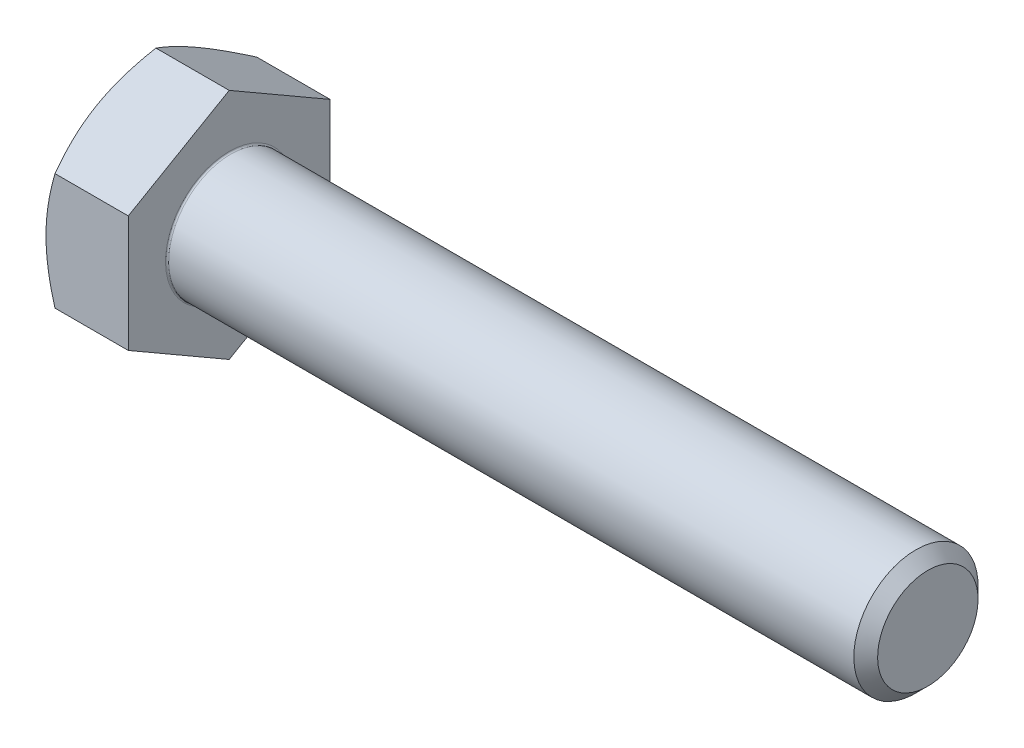
ISO-10303-21;
HEADER;
FILE_DESCRIPTION(('STEP AP214'),'2;1');
FILE_NAME('part.step','',(''),(''),'','','');
FILE_SCHEMA(('AUTOMOTIVE_DESIGN { 1 0 10303 214 1 1 1 1 }'));
ENDSEC;
DATA;
#1=APPLICATION_CONTEXT('core data for automotive mechanical design processes');
#2=APPLICATION_PROTOCOL_DEFINITION('international standard','automotive_design',2000,#1);
#3=PRODUCT_CONTEXT('',#1,'mechanical');
#4=PRODUCT('Part','Part','',(#3));
#5=PRODUCT_RELATED_PRODUCT_CATEGORY('part','',(#4));
#6=PRODUCT_DEFINITION_FORMATION('','',#4);
#7=PRODUCT_DEFINITION_CONTEXT('part definition',#1,'design');
#8=PRODUCT_DEFINITION('design','',#6,#7);
#9=PRODUCT_DEFINITION_SHAPE('','',#8);
#10=(LENGTH_UNIT() NAMED_UNIT(*) SI_UNIT(.MILLI.,.METRE.));
#11=(NAMED_UNIT(*) PLANE_ANGLE_UNIT() SI_UNIT($,.RADIAN.));
#12=(NAMED_UNIT(*) SI_UNIT($,.STERADIAN.) SOLID_ANGLE_UNIT());
#13=UNCERTAINTY_MEASURE_WITH_UNIT(LENGTH_MEASURE(1.E-05),#10,'distance_accuracy_value','');
#14=(GEOMETRIC_REPRESENTATION_CONTEXT(3) GLOBAL_UNCERTAINTY_ASSIGNED_CONTEXT((#13)) GLOBAL_UNIT_ASSIGNED_CONTEXT((#10,
#11,#12)) REPRESENTATION_CONTEXT('',''));
#15=CARTESIAN_POINT('',(0.,0.,0.));
#16=DIRECTION('',(0.,0.,1.));
#17=DIRECTION('',(1.,0.,0.));
#18=AXIS2_PLACEMENT_3D('',#15,#16,#17);
#19=CARTESIAN_POINT('',(-5.3,0.,0.));
#20=DIRECTION('',(1.,0.,0.));
#21=DIRECTION('',(0.,1.,0.));
#22=AXIS2_PLACEMENT_3D('',#19,#20,#21);
#23=PLANE('',#22);
#24=CARTESIAN_POINT('',(-5.3,0.,0.));
#25=DIRECTION('',(-1.,0.,0.));
#26=DIRECTION('',(0.,1.,0.));
#27=AXIS2_PLACEMENT_3D('',#24,#25,#26);
#28=CIRCLE('',#27,6.5);
#29=CARTESIAN_POINT('',(-5.3,5.62916512459885,-3.25));
#30=VERTEX_POINT('',#29);
#31=CARTESIAN_POINT('',(-5.3,0.,-6.5));
#32=VERTEX_POINT('',#31);
#33=EDGE_CURVE('E247',#30,#32,#28,.T.);
#34=ORIENTED_EDGE('',*,*,#33,.T.);
#35=CARTESIAN_POINT('',(-5.3,0.,0.));
#36=DIRECTION('',(-1.,0.,0.));
#37=DIRECTION('',(0.,1.,0.));
#38=AXIS2_PLACEMENT_3D('',#35,#36,#37);
#39=CIRCLE('',#38,6.5);
#40=CARTESIAN_POINT('',(-5.3,-5.62916512459885,-3.25));
#41=VERTEX_POINT('',#40);
#42=EDGE_CURVE('E175',#32,#41,#39,.T.);
#43=ORIENTED_EDGE('',*,*,#42,.T.);
#44=CARTESIAN_POINT('',(-5.3,0.,0.));
#45=DIRECTION('',(-1.,0.,0.));
#46=DIRECTION('',(0.,1.,0.));
#47=AXIS2_PLACEMENT_3D('',#44,#45,#46);
#48=CIRCLE('',#47,6.5);
#49=CARTESIAN_POINT('',(-5.3,-5.62916512459885,3.25));
#50=VERTEX_POINT('',#49);
#51=EDGE_CURVE('E158',#41,#50,#48,.T.);
#52=ORIENTED_EDGE('',*,*,#51,.T.);
#53=CARTESIAN_POINT('',(-5.3,0.,0.));
#54=DIRECTION('',(-1.,0.,0.));
#55=DIRECTION('',(0.,1.,0.));
#56=AXIS2_PLACEMENT_3D('',#53,#54,#55);
#57=CIRCLE('',#56,6.5);
#58=CARTESIAN_POINT('',(-5.3,0.,6.5));
#59=VERTEX_POINT('',#58);
#60=EDGE_CURVE('E159',#50,#59,#57,.T.);
#61=ORIENTED_EDGE('',*,*,#60,.T.);
#62=CARTESIAN_POINT('',(-5.3,0.,0.));
#63=DIRECTION('',(-1.,0.,0.));
#64=DIRECTION('',(0.,1.,0.));
#65=AXIS2_PLACEMENT_3D('',#62,#63,#64);
#66=CIRCLE('',#65,6.5);
#67=CARTESIAN_POINT('',(-5.3,5.62916512459885,3.25));
#68=VERTEX_POINT('',#67);
#69=EDGE_CURVE('E146',#59,#68,#66,.T.);
#70=ORIENTED_EDGE('',*,*,#69,.T.);
#71=CARTESIAN_POINT('',(-5.3,0.,0.));
#72=DIRECTION('',(-1.,0.,0.));
#73=DIRECTION('',(0.,1.,0.));
#74=AXIS2_PLACEMENT_3D('',#71,#72,#73);
#75=CIRCLE('',#74,6.5);
#76=EDGE_CURVE('E202',#68,#30,#75,.T.);
#77=ORIENTED_EDGE('',*,*,#76,.T.);
#78=EDGE_LOOP('',(#34,#43,#52,#61,#70,#77));
#79=FACE_BOUND('',#78,.T.);
#80=ADVANCED_FACE('F16',(#79),#23,.F.);
#81=CARTESIAN_POINT('',(0.,7.50555349946513,0.));
#82=DIRECTION('',(0.,0.866025403784438,0.5));
#83=DIRECTION('',(1.,0.,0.));
#84=AXIS2_PLACEMENT_3D('',#81,#82,#83);
#85=PLANE('',#84);
#86=CARTESIAN_POINT('',(-5.3,5.62916512459885,3.25));
#87=CARTESIAN_POINT('',(-5.3,4.7583302491977,4.75833024919769));
#88=CARTESIAN_POINT('',(-4.71944341639924,3.75277674973256,6.5));
#89=(BOUNDED_CURVE() B_SPLINE_CURVE(2,(#86,#87,#88),.UNSPECIFIED.,.F.,
.F.) B_SPLINE_CURVE_WITH_KNOTS((3,3),(0.439000868202294,0.827027033445395),
.UNSPECIFIED.) CURVE() GEOMETRIC_REPRESENTATION_ITEM() RATIONAL_B_SPLINE_CURVE((1.,
1.04314139574018,1.0100187493574)) REPRESENTATION_ITEM(''));
#90=CARTESIAN_POINT('',(-4.71944341639924,3.75277674973256,6.5));
#91=VERTEX_POINT('',#90);
#92=EDGE_CURVE('E150',#68,#91,#89,.T.);
#93=ORIENTED_EDGE('',*,*,#92,.T.);
#94=DIRECTION('',(-1.,0.,0.));
#95=VECTOR('',#94,1.);
#96=CARTESIAN_POINT('',(0.,3.75277674973256,6.5));
#97=LINE('',#96,#95);
#98=CARTESIAN_POINT('',(0.,3.75277674973256,6.5));
#99=VERTEX_POINT('',#98);
#100=EDGE_CURVE('E20',#99,#91,#97,.T.);
#101=ORIENTED_EDGE('',*,*,#100,.F.);
#102=DIRECTION('',(0.,-0.5,0.866025403784438));
#103=VECTOR('',#102,1.);
#104=CARTESIAN_POINT('',(0.,7.50555349946513,0.));
#105=LINE('',#104,#103);
#106=CARTESIAN_POINT('',(0.,7.50555349946513,0.));
#107=VERTEX_POINT('',#106);
#108=EDGE_CURVE('E266',#107,#99,#105,.T.);
#109=ORIENTED_EDGE('',*,*,#108,.F.);
#110=DIRECTION('',(-1.,0.,0.));
#111=VECTOR('',#110,1.);
#112=CARTESIAN_POINT('',(0.,7.50555349946513,0.));
#113=LINE('',#112,#111);
#114=CARTESIAN_POINT('',(-4.71944341639924,7.50555349946513,0.));
#115=VERTEX_POINT('',#114);
#116=EDGE_CURVE('E11',#107,#115,#113,.T.);
#117=ORIENTED_EDGE('',*,*,#116,.T.);
#118=CARTESIAN_POINT('',(-4.71944341639924,7.50555349946513,0.));
#119=CARTESIAN_POINT('',(-5.3,6.5,1.74166975080231));
#120=CARTESIAN_POINT('',(-5.3,5.62916512459885,3.25));
#121=(BOUNDED_CURVE() B_SPLINE_CURVE(2,(#118,#119,#120),.UNSPECIFIED.,.F.,
.F.) B_SPLINE_CURVE_WITH_KNOTS((3,3),(0.050974702959193,0.439000868202294),
.UNSPECIFIED.) CURVE() GEOMETRIC_REPRESENTATION_ITEM() RATIONAL_B_SPLINE_CURVE((1.01001874935741,
1.04314139574019,1.)) REPRESENTATION_ITEM(''));
#122=EDGE_CURVE('E226',#115,#68,#121,.T.);
#123=ORIENTED_EDGE('',*,*,#122,.T.);
#124=EDGE_LOOP('',(#93,#101,#109,#117,#123));
#125=FACE_BOUND('',#124,.T.);
#126=ADVANCED_FACE('F354',(#125),#85,.T.);
#127=CARTESIAN_POINT('',(0.,3.75277674973257,-6.5));
#128=DIRECTION('',(0.,0.866025403784439,-0.5));
#129=DIRECTION('',(-1.,0.,0.));
#130=AXIS2_PLACEMENT_3D('',#127,#128,#129);
#131=PLANE('',#130);
#132=CARTESIAN_POINT('',(-5.3,5.62916512459885,-3.25));
#133=CARTESIAN_POINT('',(-5.3,6.49999999999999,-1.7416697508023));
#134=CARTESIAN_POINT('',(-4.71944341639924,7.50555349946513,0.));
#135=(BOUNDED_CURVE() B_SPLINE_CURVE(2,(#132,#133,#134),.UNSPECIFIED.,.F.,
.F.) B_SPLINE_CURVE_WITH_KNOTS((3,3),(0.439000868202294,0.827027033445395),
.UNSPECIFIED.) CURVE() GEOMETRIC_REPRESENTATION_ITEM() RATIONAL_B_SPLINE_CURVE((1.,
1.04314139574018,1.0100187493574)) REPRESENTATION_ITEM(''));
#136=EDGE_CURVE('E209',#30,#115,#135,.T.);
#137=ORIENTED_EDGE('',*,*,#136,.T.);
#138=ORIENTED_EDGE('',*,*,#116,.F.);
#139=DIRECTION('',(0.,0.5,0.866025403784439));
#140=VECTOR('',#139,1.);
#141=CARTESIAN_POINT('',(0.,3.75277674973257,-6.5));
#142=LINE('',#141,#140);
#143=CARTESIAN_POINT('',(0.,3.75277674973257,-6.5));
#144=VERTEX_POINT('',#143);
#145=EDGE_CURVE('E123',#144,#107,#142,.T.);
#146=ORIENTED_EDGE('',*,*,#145,.F.);
#147=DIRECTION('',(-1.,0.,0.));
#148=VECTOR('',#147,1.);
#149=CARTESIAN_POINT('',(0.,3.75277674973257,-6.5));
#150=LINE('',#149,#148);
#151=CARTESIAN_POINT('',(-4.71944341639924,3.75277674973257,-6.5));
#152=VERTEX_POINT('',#151);
#153=EDGE_CURVE('E39',#144,#152,#150,.T.);
#154=ORIENTED_EDGE('',*,*,#153,.T.);
#155=CARTESIAN_POINT('',(-4.71944341639924,3.75277674973257,-6.49999999999999));
#156=CARTESIAN_POINT('',(-5.3,4.75833024919771,-4.75833024919768));
#157=CARTESIAN_POINT('',(-5.3,5.62916512459885,-3.25));
#158=(BOUNDED_CURVE() B_SPLINE_CURVE(2,(#155,#156,#157),.UNSPECIFIED.,.F.,
.F.) B_SPLINE_CURVE_WITH_KNOTS((3,3),(0.0509747029591937,0.439000868202294),
.UNSPECIFIED.) CURVE() GEOMETRIC_REPRESENTATION_ITEM() RATIONAL_B_SPLINE_CURVE((1.0100187493574,
1.04314139574017,1.)) REPRESENTATION_ITEM(''));
#159=EDGE_CURVE('E268',#152,#30,#158,.T.);
#160=ORIENTED_EDGE('',*,*,#159,.T.);
#161=EDGE_LOOP('',(#137,#138,#146,#154,#160));
#162=FACE_BOUND('',#161,.T.);
#163=ADVANCED_FACE('F125',(#162),#131,.T.);
#164=CARTESIAN_POINT('',(0.,3.75277674973256,6.5));
#165=DIRECTION('',(0.,0.,1.));
#166=DIRECTION('',(0.,-1.,0.));
#167=AXIS2_PLACEMENT_3D('',#164,#165,#166);
#168=PLANE('',#167);
#169=CARTESIAN_POINT('',(-5.3,0.,6.5));
#170=CARTESIAN_POINT('',(-5.3,-1.74166975080229,6.5));
#171=CARTESIAN_POINT('',(-4.71944341639924,-3.75277674973257,6.49999999999999));
#172=(BOUNDED_CURVE() B_SPLINE_CURVE(2,(#169,#170,#171),.UNSPECIFIED.,.F.,
.F.) B_SPLINE_CURVE_WITH_KNOTS((3,3),(0.439000868202295,0.827027033445395),
.UNSPECIFIED.) CURVE() GEOMETRIC_REPRESENTATION_ITEM() RATIONAL_B_SPLINE_CURVE((1.,
1.04314139574018,1.0100187493574)) REPRESENTATION_ITEM(''));
#173=CARTESIAN_POINT('',(-4.71944341639924,-3.75277674973257,6.5));
#174=VERTEX_POINT('',#173);
#175=EDGE_CURVE('E166',#59,#174,#172,.T.);
#176=ORIENTED_EDGE('',*,*,#175,.T.);
#177=DIRECTION('',(-1.,0.,0.));
#178=VECTOR('',#177,1.);
#179=CARTESIAN_POINT('',(0.,-3.75277674973257,6.5));
#180=LINE('',#179,#178);
#181=CARTESIAN_POINT('',(0.,-3.75277674973257,6.5));
#182=VERTEX_POINT('',#181);
#183=EDGE_CURVE('E215',#182,#174,#180,.T.);
#184=ORIENTED_EDGE('',*,*,#183,.F.);
#185=DIRECTION('',(0.,-1.,0.));
#186=VECTOR('',#185,1.);
#187=CARTESIAN_POINT('',(0.,3.75277674973256,6.5));
#188=LINE('',#187,#186);
#189=EDGE_CURVE('E145',#99,#182,#188,.T.);
#190=ORIENTED_EDGE('',*,*,#189,.F.);
#191=ORIENTED_EDGE('',*,*,#100,.T.);
#192=CARTESIAN_POINT('',(-4.71944341639924,3.75277674973256,6.5));
#193=CARTESIAN_POINT('',(-5.3,1.74166975080229,6.50000000000001));
#194=CARTESIAN_POINT('',(-5.3,0.,6.5));
#195=(BOUNDED_CURVE() B_SPLINE_CURVE(2,(#192,#193,#194),.UNSPECIFIED.,.F.,
.F.) B_SPLINE_CURVE_WITH_KNOTS((3,3),(0.0509747029591941,0.439000868202295),
.UNSPECIFIED.) CURVE() GEOMETRIC_REPRESENTATION_ITEM() RATIONAL_B_SPLINE_CURVE((1.01001874935741,
1.04314139574019,1.)) REPRESENTATION_ITEM(''));
#196=EDGE_CURVE('E193',#91,#59,#195,.T.);
#197=ORIENTED_EDGE('',*,*,#196,.T.);
#198=EDGE_LOOP('',(#176,#184,#190,#191,#197));
#199=FACE_BOUND('',#198,.T.);
#200=ADVANCED_FACE('F353',(#199),#168,.T.);
#201=CARTESIAN_POINT('',(0.,-3.75277674973256,-6.5));
#202=DIRECTION('',(0.,0.,-1.));
#203=DIRECTION('',(-1.,0.,0.));
#204=AXIS2_PLACEMENT_3D('',#201,#202,#203);
#205=PLANE('',#204);
#206=CARTESIAN_POINT('',(-4.71944341639924,-3.75277674973256,-6.5));
#207=CARTESIAN_POINT('',(-5.3,-1.74166975080228,-6.50000000000001));
#208=CARTESIAN_POINT('',(-5.3,0.,-6.5));
#209=(BOUNDED_CURVE() B_SPLINE_CURVE(2,(#206,#207,#208),.UNSPECIFIED.,.F.,
.F.) B_SPLINE_CURVE_WITH_KNOTS((3,3),(0.0509747029591942,0.439000868202295),
.UNSPECIFIED.) CURVE() GEOMETRIC_REPRESENTATION_ITEM() RATIONAL_B_SPLINE_CURVE((1.0100187493574,
1.04314139574017,1.)) REPRESENTATION_ITEM(''));
#210=CARTESIAN_POINT('',(-4.71944341639924,-3.75277674973256,-6.5));
#211=VERTEX_POINT('',#210);
#212=EDGE_CURVE('E179',#211,#32,#209,.T.);
#213=ORIENTED_EDGE('',*,*,#212,.T.);
#214=CARTESIAN_POINT('',(-5.3,0.,-6.5));
#215=CARTESIAN_POINT('',(-5.3,1.74166975080229,-6.49999999999999));
#216=CARTESIAN_POINT('',(-4.71944341639924,3.75277674973257,-6.49999999999999));
#217=(BOUNDED_CURVE() B_SPLINE_CURVE(2,(#214,#215,#216),.UNSPECIFIED.,.F.,
.F.) B_SPLINE_CURVE_WITH_KNOTS((3,3),(0.439000868202295,0.827027033445395),
.UNSPECIFIED.) CURVE() GEOMETRIC_REPRESENTATION_ITEM() RATIONAL_B_SPLINE_CURVE((1.,
1.04314139574018,1.0100187493574)) REPRESENTATION_ITEM(''));
#218=EDGE_CURVE('E117',#32,#152,#217,.T.);
#219=ORIENTED_EDGE('',*,*,#218,.T.);
#220=ORIENTED_EDGE('',*,*,#153,.F.);
#221=DIRECTION('',(0.,1.,0.));
#222=VECTOR('',#221,1.);
#223=CARTESIAN_POINT('',(0.,-3.75277674973256,-6.5));
#224=LINE('',#223,#222);
#225=CARTESIAN_POINT('',(0.,-3.75277674973256,-6.5));
#226=VERTEX_POINT('',#225);
#227=EDGE_CURVE('E114',#226,#144,#224,.T.);
#228=ORIENTED_EDGE('',*,*,#227,.F.);
#229=DIRECTION('',(-1.,0.,0.));
#230=VECTOR('',#229,1.);
#231=CARTESIAN_POINT('',(0.,-3.75277674973256,-6.5));
#232=LINE('',#231,#230);
#233=EDGE_CURVE('E119',#226,#211,#232,.T.);
#234=ORIENTED_EDGE('',*,*,#233,.T.);
#235=EDGE_LOOP('',(#213,#219,#220,#228,#234));
#236=FACE_BOUND('',#235,.T.);
#237=ADVANCED_FACE('F111',(#236),#205,.T.);
#238=CARTESIAN_POINT('',(0.,-7.50555349946513,0.));
#239=DIRECTION('',(0.,-0.866025403784439,-0.5));
#240=DIRECTION('',(0.,0.5,-0.866025403784439));
#241=AXIS2_PLACEMENT_3D('',#238,#239,#240);
#242=PLANE('',#241);
#243=CARTESIAN_POINT('',(-4.71944341639924,-7.50555349946513,0.));
#244=CARTESIAN_POINT('',(-5.3,-6.5,-1.74166975080231));
#245=CARTESIAN_POINT('',(-5.3,-5.62916512459885,-3.25));
#246=(BOUNDED_CURVE() B_SPLINE_CURVE(2,(#243,#244,#245),.UNSPECIFIED.,.F.,
.F.) B_SPLINE_CURVE_WITH_KNOTS((3,3),(0.0509747029591947,0.439000868202295),
.UNSPECIFIED.) CURVE() GEOMETRIC_REPRESENTATION_ITEM() RATIONAL_B_SPLINE_CURVE((1.0100187493574,
1.04314139574017,1.)) REPRESENTATION_ITEM(''));
#247=CARTESIAN_POINT('',(-4.71944341639924,-7.50555349946513,0.));
#248=VERTEX_POINT('',#247);
#249=EDGE_CURVE('E151',#248,#41,#246,.T.);
#250=ORIENTED_EDGE('',*,*,#249,.T.);
#251=CARTESIAN_POINT('',(-5.3,-5.62916512459885,-3.25));
#252=CARTESIAN_POINT('',(-5.3,-4.7583302491977,-4.7583302491977));
#253=CARTESIAN_POINT('',(-4.71944341639924,-3.75277674973256,-6.5));
#254=(BOUNDED_CURVE() B_SPLINE_CURVE(2,(#251,#252,#253),.UNSPECIFIED.,.F.,
.F.) B_SPLINE_CURVE_WITH_KNOTS((3,3),(0.439000868202295,0.827027033445396),
.UNSPECIFIED.) CURVE() GEOMETRIC_REPRESENTATION_ITEM() RATIONAL_B_SPLINE_CURVE((1.,
1.04314139574018,1.0100187493574)) REPRESENTATION_ITEM(''));
#255=EDGE_CURVE('E157',#41,#211,#254,.T.);
#256=ORIENTED_EDGE('',*,*,#255,.T.);
#257=ORIENTED_EDGE('',*,*,#233,.F.);
#258=DIRECTION('',(0.,0.5,-0.866025403784438));
#259=VECTOR('',#258,1.);
#260=CARTESIAN_POINT('',(0.,-7.50555349946513,0.));
#261=LINE('',#260,#259);
#262=CARTESIAN_POINT('',(0.,-7.50555349946513,0.));
#263=VERTEX_POINT('',#262);
#264=EDGE_CURVE('E134',#263,#226,#261,.T.);
#265=ORIENTED_EDGE('',*,*,#264,.F.);
#266=DIRECTION('',(-1.,0.,0.));
#267=VECTOR('',#266,1.);
#268=CARTESIAN_POINT('',(0.,-7.50555349946513,0.));
#269=LINE('',#268,#267);
#270=EDGE_CURVE('E222',#263,#248,#269,.T.);
#271=ORIENTED_EDGE('',*,*,#270,.T.);
#272=EDGE_LOOP('',(#250,#256,#257,#265,#271));
#273=FACE_BOUND('',#272,.T.);
#274=ADVANCED_FACE('F303',(#273),#242,.T.);
#275=CARTESIAN_POINT('',(0.,-3.75277674973257,6.5));
#276=DIRECTION('',(0.,-0.866025403784439,0.5));
#277=DIRECTION('',(-1.,0.,0.));
#278=AXIS2_PLACEMENT_3D('',#275,#276,#277);
#279=PLANE('',#278);
#280=CARTESIAN_POINT('',(-4.71944341639924,-3.75277674973257,6.49999999999999));
#281=CARTESIAN_POINT('',(-5.30000000000001,-4.75833024919771,4.75833024919769));
#282=CARTESIAN_POINT('',(-5.3,-5.62916512459885,3.25));
#283=(BOUNDED_CURVE() B_SPLINE_CURVE(2,(#280,#281,#282),.UNSPECIFIED.,.F.,
.F.) B_SPLINE_CURVE_WITH_KNOTS((3,3),(0.0509747029591935,0.439000868202295),
.UNSPECIFIED.) CURVE() GEOMETRIC_REPRESENTATION_ITEM() RATIONAL_B_SPLINE_CURVE((1.01001874935741,
1.04314139574019,1.)) REPRESENTATION_ITEM(''));
#284=EDGE_CURVE('E149',#174,#50,#283,.T.);
#285=ORIENTED_EDGE('',*,*,#284,.T.);
#286=CARTESIAN_POINT('',(-5.3,-5.62916512459885,3.25));
#287=CARTESIAN_POINT('',(-5.30000000000001,-6.49999999999999,1.74166975080231));
#288=CARTESIAN_POINT('',(-4.71944341639924,-7.50555349946513,0.));
#289=(BOUNDED_CURVE() B_SPLINE_CURVE(2,(#286,#287,#288),.UNSPECIFIED.,.F.,
.F.) B_SPLINE_CURVE_WITH_KNOTS((3,3),(0.439000868202295,0.827027033445396),
.UNSPECIFIED.) CURVE() GEOMETRIC_REPRESENTATION_ITEM() RATIONAL_B_SPLINE_CURVE((1.,
1.04314139574018,1.0100187493574)) REPRESENTATION_ITEM(''));
#290=EDGE_CURVE('E165',#50,#248,#289,.T.);
#291=ORIENTED_EDGE('',*,*,#290,.T.);
#292=ORIENTED_EDGE('',*,*,#270,.F.);
#293=DIRECTION('',(0.,-0.5,-0.866025403784439));
#294=VECTOR('',#293,1.);
#295=CARTESIAN_POINT('',(0.,-3.75277674973257,6.5));
#296=LINE('',#295,#294);
#297=EDGE_CURVE('E141',#182,#263,#296,.T.);
#298=ORIENTED_EDGE('',*,*,#297,.F.);
#299=ORIENTED_EDGE('',*,*,#183,.T.);
#300=EDGE_LOOP('',(#285,#291,#292,#298,#299));
#301=FACE_BOUND('',#300,.T.);
#302=ADVANCED_FACE('F344',(#301),#279,.T.);
#303=CARTESIAN_POINT('',(-4.92472232502675,0.,0.));
#304=DIRECTION('',(1.,0.,0.));
#305=DIRECTION('',(0.,1.,0.));
#306=AXIS2_PLACEMENT_3D('',#303,#304,#305);
#307=CONICAL_SURFACE('',#306,7.15,1.0471975512);
#308=ORIENTED_EDGE('',*,*,#218,.F.);
#309=ORIENTED_EDGE('',*,*,#33,.F.);
#310=ORIENTED_EDGE('',*,*,#159,.F.);
#311=EDGE_LOOP('',(#308,#309,#310));
#312=FACE_BOUND('',#311,.T.);
#313=ADVANCED_FACE('F375',(#312),#307,.T.);
#314=CARTESIAN_POINT('',(-4.92472232502675,0.,0.));
#315=DIRECTION('',(1.,0.,0.));
#316=DIRECTION('',(0.,1.,0.));
#317=AXIS2_PLACEMENT_3D('',#314,#315,#316);
#318=CONICAL_SURFACE('',#317,7.15,1.0471975512);
#319=ORIENTED_EDGE('',*,*,#255,.F.);
#320=ORIENTED_EDGE('',*,*,#42,.F.);
#321=ORIENTED_EDGE('',*,*,#212,.F.);
#322=EDGE_LOOP('',(#319,#320,#321));
#323=FACE_BOUND('',#322,.T.);
#324=ADVANCED_FACE('F302',(#323),#318,.T.);
#325=CARTESIAN_POINT('',(-4.92472232502675,0.,0.));
#326=DIRECTION('',(1.,0.,0.));
#327=DIRECTION('',(0.,1.,0.));
#328=AXIS2_PLACEMENT_3D('',#325,#326,#327);
#329=CONICAL_SURFACE('',#328,7.15,1.0471975512);
#330=ORIENTED_EDGE('',*,*,#290,.F.);
#331=ORIENTED_EDGE('',*,*,#51,.F.);
#332=ORIENTED_EDGE('',*,*,#249,.F.);
#333=EDGE_LOOP('',(#330,#331,#332));
#334=FACE_BOUND('',#333,.T.);
#335=ADVANCED_FACE('F310',(#334),#329,.T.);
#336=CARTESIAN_POINT('',(-4.92472232502675,0.,0.));
#337=DIRECTION('',(1.,0.,0.));
#338=DIRECTION('',(0.,1.,0.));
#339=AXIS2_PLACEMENT_3D('',#336,#337,#338);
#340=CONICAL_SURFACE('',#339,7.15,1.0471975512);
#341=ORIENTED_EDGE('',*,*,#284,.F.);
#342=ORIENTED_EDGE('',*,*,#175,.F.);
#343=ORIENTED_EDGE('',*,*,#60,.F.);
#344=EDGE_LOOP('',(#341,#342,#343));
#345=FACE_BOUND('',#344,.T.);
#346=ADVANCED_FACE('F414',(#345),#340,.T.);
#347=CARTESIAN_POINT('',(-4.92472232502675,0.,0.));
#348=DIRECTION('',(1.,0.,0.));
#349=DIRECTION('',(0.,1.,0.));
#350=AXIS2_PLACEMENT_3D('',#347,#348,#349);
#351=CONICAL_SURFACE('',#350,7.15,1.0471975512);
#352=ORIENTED_EDGE('',*,*,#196,.F.);
#353=ORIENTED_EDGE('',*,*,#92,.F.);
#354=ORIENTED_EDGE('',*,*,#69,.F.);
#355=EDGE_LOOP('',(#352,#353,#354));
#356=FACE_BOUND('',#355,.T.);
#357=ADVANCED_FACE('F419',(#356),#351,.T.);
#358=CARTESIAN_POINT('',(-4.92472232502675,0.,0.));
#359=DIRECTION('',(1.,0.,0.));
#360=DIRECTION('',(0.,1.,0.));
#361=AXIS2_PLACEMENT_3D('',#358,#359,#360);
#362=CONICAL_SURFACE('',#361,7.15,1.0471975512);
#363=ORIENTED_EDGE('',*,*,#122,.F.);
#364=ORIENTED_EDGE('',*,*,#136,.F.);
#365=ORIENTED_EDGE('',*,*,#76,.F.);
#366=EDGE_LOOP('',(#363,#364,#365));
#367=FACE_BOUND('',#366,.T.);
#368=ADVANCED_FACE('F334',(#367),#362,.T.);
#369=CARTESIAN_POINT('',(45.,2.,0.));
#370=DIRECTION('',(1.,0.,0.));
#371=DIRECTION('',(0.,1.,0.));
#372=AXIS2_PLACEMENT_3D('',#369,#370,#371);
#373=PLANE('',#372);
#374=CARTESIAN_POINT('',(45.,0.,0.));
#375=DIRECTION('',(-1.,0.,0.));
#376=DIRECTION('',(0.,-1.,0.));
#377=AXIS2_PLACEMENT_3D('',#374,#375,#376);
#378=CIRCLE('',#377,3.2331875);
#379=CARTESIAN_POINT('',(45.,3.23318750000001,0.));
#380=VERTEX_POINT('',#379);
#381=EDGE_CURVE('E104',#380,#380,#378,.T.);
#382=ORIENTED_EDGE('',*,*,#381,.F.);
#383=EDGE_LOOP('',(#382));
#384=FACE_BOUND('',#383,.T.);
#385=ADVANCED_FACE('F18',(#384),#373,.T.);
#386=CARTESIAN_POINT('',(44.61654375,0.,0.));
#387=DIRECTION('',(-1.,0.,0.));
#388=DIRECTION('',(0.,-1.,0.));
#389=AXIS2_PLACEMENT_3D('',#386,#387,#388);
#390=CONICAL_SURFACE('',#389,3.61659375,0.785332962663323);
#391=ORIENTED_EDGE('',*,*,#381,.T.);
#392=EDGE_LOOP('',(#391));
#393=FACE_BOUND('',#392,.T.);
#394=CARTESIAN_POINT('',(44.2330875,0.,0.));
#395=DIRECTION('',(1.,0.,0.));
#396=DIRECTION('',(0.,-1.,0.));
#397=AXIS2_PLACEMENT_3D('',#394,#395,#396);
#398=CIRCLE('',#397,4.);
#399=CARTESIAN_POINT('',(44.2330875,4.,0.));
#400=VERTEX_POINT('',#399);
#401=EDGE_CURVE('E170',#400,#400,#398,.T.);
#402=ORIENTED_EDGE('',*,*,#401,.T.);
#403=EDGE_LOOP('',(#402));
#404=FACE_BOUND('',#403,.T.);
#405=ADVANCED_FACE('F333',(#393,#404),#390,.T.);
#406=CARTESIAN_POINT('',(0.,0.,0.));
#407=DIRECTION('',(1.,0.,0.));
#408=DIRECTION('',(0.,1.,0.));
#409=AXIS2_PLACEMENT_3D('',#406,#407,#408);
#410=PLANE('',#409);
#411=CARTESIAN_POINT('',(0.,0.,0.));
#412=DIRECTION('',(1.,0.,0.));
#413=DIRECTION('',(0.,-1.,0.));
#414=AXIS2_PLACEMENT_3D('',#411,#412,#413);
#415=CIRCLE('',#414,4.1);
#416=CARTESIAN_POINT('',(0.,4.1,0.));
#417=VERTEX_POINT('',#416);
#418=EDGE_CURVE('E171',#417,#417,#415,.T.);
#419=ORIENTED_EDGE('',*,*,#418,.F.);
#420=EDGE_LOOP('',(#419));
#421=FACE_BOUND('',#420,.T.);
#422=ORIENTED_EDGE('',*,*,#108,.T.);
#423=ORIENTED_EDGE('',*,*,#189,.T.);
#424=ORIENTED_EDGE('',*,*,#297,.T.);
#425=ORIENTED_EDGE('',*,*,#264,.T.);
#426=ORIENTED_EDGE('',*,*,#227,.T.);
#427=ORIENTED_EDGE('',*,*,#145,.T.);
#428=EDGE_LOOP('',(#422,#423,#424,#425,#426,#427));
#429=FACE_BOUND('',#428,.T.);
#430=ADVANCED_FACE('F131',(#421,#429),#410,.T.);
#431=CARTESIAN_POINT('',(22.5,0.,0.));
#432=DIRECTION('',(1.,0.,0.));
#433=DIRECTION('',(0.,1.,0.));
#434=AXIS2_PLACEMENT_3D('',#431,#432,#433);
#435=CYLINDRICAL_SURFACE('',#434,4.);
#436=CARTESIAN_POINT('',(0.0999999999999979,0.,0.));
#437=DIRECTION('',(-1.,0.,0.));
#438=DIRECTION('',(0.,-1.,0.));
#439=AXIS2_PLACEMENT_3D('',#436,#437,#438);
#440=CIRCLE('',#439,4.);
#441=CARTESIAN_POINT('',(0.0999999999999976,4.,0.));
#442=VERTEX_POINT('',#441);
#443=EDGE_CURVE('E167',#442,#442,#440,.T.);
#444=ORIENTED_EDGE('',*,*,#443,.F.);
#445=EDGE_LOOP('',(#444));
#446=FACE_BOUND('',#445,.T.);
#447=ORIENTED_EDGE('',*,*,#401,.F.);
#448=EDGE_LOOP('',(#447));
#449=FACE_BOUND('',#448,.T.);
#450=ADVANCED_FACE('F360',(#446,#449),#435,.T.);
#451=CARTESIAN_POINT('',(0.0999999999999979,0.,0.));
#452=DIRECTION('',(1.,0.,0.));
#453=DIRECTION('',(0.,0.,-1.));
#454=AXIS2_PLACEMENT_3D('',#451,#452,#453);
#455=TOROIDAL_SURFACE('',#454,4.1,0.1);
#456=ORIENTED_EDGE('',*,*,#443,.T.);
#457=EDGE_LOOP('',(#456));
#458=FACE_BOUND('',#457,.T.);
#459=ORIENTED_EDGE('',*,*,#418,.T.);
#460=EDGE_LOOP('',(#459));
#461=FACE_BOUND('',#460,.T.);
#462=ADVANCED_FACE('F365',(#458,#461),#455,.F.);
#463=CLOSED_SHELL('',(#80,#126,#163,#200,#237,#274,#302,#313,#324,#335,#346,#357,#368,#385,#405,
#430,#450,#462));
#464=MANIFOLD_SOLID_BREP('B1',#463);
#465=ADVANCED_BREP_SHAPE_REPRESENTATION('',(#18,#464),#14);
#466=SHAPE_DEFINITION_REPRESENTATION(#9,#465);
ENDSEC;
END-ISO-10303-21;
